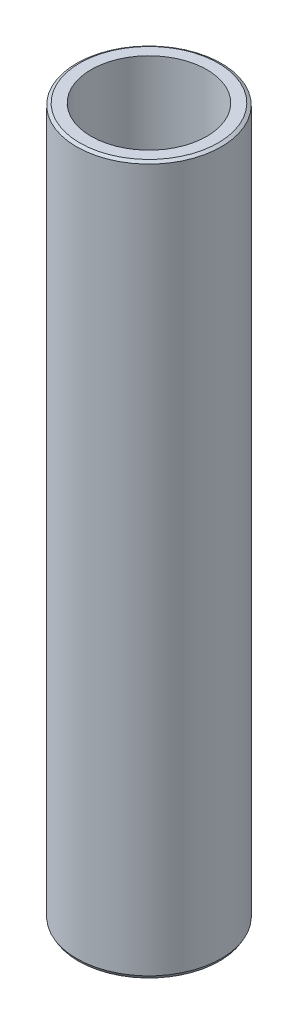
ISO-10303-21;
HEADER;
FILE_DESCRIPTION(('STEP AP214'),'2;1');
FILE_NAME('part.step','',(''),(''),'','','');
FILE_SCHEMA(('AUTOMOTIVE_DESIGN { 1 0 10303 214 1 1 1 1 }'));
ENDSEC;
DATA;
#1=APPLICATION_CONTEXT('core data for automotive mechanical design processes');
#2=APPLICATION_PROTOCOL_DEFINITION('international standard','automotive_design',2000,#1);
#3=PRODUCT_CONTEXT('',#1,'mechanical');
#4=PRODUCT('Part','Part','',(#3));
#5=PRODUCT_RELATED_PRODUCT_CATEGORY('part','',(#4));
#6=PRODUCT_DEFINITION_FORMATION('','',#4);
#7=PRODUCT_DEFINITION_CONTEXT('part definition',#1,'design');
#8=PRODUCT_DEFINITION('design','',#6,#7);
#9=PRODUCT_DEFINITION_SHAPE('','',#8);
#10=(LENGTH_UNIT() NAMED_UNIT(*) SI_UNIT(.MILLI.,.METRE.));
#11=(NAMED_UNIT(*) PLANE_ANGLE_UNIT() SI_UNIT($,.RADIAN.));
#12=(NAMED_UNIT(*) SI_UNIT($,.STERADIAN.) SOLID_ANGLE_UNIT());
#13=UNCERTAINTY_MEASURE_WITH_UNIT(LENGTH_MEASURE(1.E-05),#10,'distance_accuracy_value','');
#14=(GEOMETRIC_REPRESENTATION_CONTEXT(3) GLOBAL_UNCERTAINTY_ASSIGNED_CONTEXT((#13)) GLOBAL_UNIT_ASSIGNED_CONTEXT((#10,
#11,#12)) REPRESENTATION_CONTEXT('',''));
#15=CARTESIAN_POINT('',(0.,0.,0.));
#16=DIRECTION('',(0.,0.,1.));
#17=DIRECTION('',(1.,0.,0.));
#18=AXIS2_PLACEMENT_3D('',#15,#16,#17);
#19=CARTESIAN_POINT('',(0.,513.77342198026,0.));
#20=DIRECTION('',(0.,-1.,0.));
#21=DIRECTION('',(0.,0.,-1.));
#22=AXIS2_PLACEMENT_3D('',#19,#20,#21);
#23=CYLINDRICAL_SURFACE('',#22,52.5);
#24=CARTESIAN_POINT('',(0.,512.458148156772,0.));
#25=DIRECTION('',(0.,1.,0.));
#26=DIRECTION('',(0.,0.,1.));
#27=AXIS2_PLACEMENT_3D('',#24,#25,#26);
#28=CIRCLE('',#27,52.5);
#29=CARTESIAN_POINT('',(0.,512.458148156772,52.5));
#30=VERTEX_POINT('',#29);
#31=EDGE_CURVE('E50',#30,#30,#28,.F.);
#32=ORIENTED_EDGE('',*,*,#31,.T.);
#33=EDGE_LOOP('',(#32));
#34=FACE_BOUND('',#33,.T.);
#35=CARTESIAN_POINT('',(0.,2.27812108814751,0.));
#36=DIRECTION('',(0.,1.,0.));
#37=DIRECTION('',(0.,0.,1.));
#38=AXIS2_PLACEMENT_3D('',#35,#36,#37);
#39=CIRCLE('',#38,52.5);
#40=CARTESIAN_POINT('',(0.,2.27812108814751,52.5));
#41=VERTEX_POINT('',#40);
#42=EDGE_CURVE('E51',#41,#41,#39,.T.);
#43=ORIENTED_EDGE('',*,*,#42,.T.);
#44=EDGE_LOOP('',(#43));
#45=FACE_BOUND('',#44,.T.);
#46=ADVANCED_FACE('F39',(#34,#45),#23,.T.);
#47=CARTESIAN_POINT('',(0.,513.77342198026,0.));
#48=DIRECTION('',(0.,1.,0.));
#49=DIRECTION('',(0.,0.,1.));
#50=AXIS2_PLACEMENT_3D('',#47,#48,#49);
#51=PLANE('',#50);
#52=CARTESIAN_POINT('',(0.,513.77342198026,0.));
#53=DIRECTION('',(0.,1.,0.));
#54=DIRECTION('',(0.,0.,1.));
#55=AXIS2_PLACEMENT_3D('',#52,#53,#54);
#56=CIRCLE('',#55,50.2218789118524);
#57=CARTESIAN_POINT('',(0.,513.77342198026,50.2218789118524));
#58=VERTEX_POINT('',#57);
#59=EDGE_CURVE('E54',#58,#58,#56,.T.);
#60=ORIENTED_EDGE('',*,*,#59,.T.);
#61=EDGE_LOOP('',(#60));
#62=FACE_BOUND('',#61,.T.);
#63=CARTESIAN_POINT('',(0.,513.77342198026,0.));
#64=DIRECTION('',(0.,1.,0.));
#65=DIRECTION('',(0.,0.,1.));
#66=AXIS2_PLACEMENT_3D('',#63,#64,#65);
#67=CIRCLE('',#66,41.9791879624852);
#68=CARTESIAN_POINT('',(0.,513.77342198026,41.9791879624852));
#69=VERTEX_POINT('',#68);
#70=EDGE_CURVE('E58',#69,#69,#67,.T.);
#71=ORIENTED_EDGE('',*,*,#70,.F.);
#72=EDGE_LOOP('',(#71));
#73=FACE_BOUND('',#72,.T.);
#74=ADVANCED_FACE('F69',(#62,#73),#51,.T.);
#75=CARTESIAN_POINT('',(0.,0.,0.));
#76=DIRECTION('',(0.,1.,0.));
#77=DIRECTION('',(0.,0.,1.));
#78=AXIS2_PLACEMENT_3D('',#75,#76,#77);
#79=PLANE('',#78);
#80=CARTESIAN_POINT('',(0.,0.,0.));
#81=DIRECTION('',(0.,1.,0.));
#82=DIRECTION('',(0.,0.,1.));
#83=AXIS2_PLACEMENT_3D('',#80,#81,#82);
#84=CIRCLE('',#83,51.1847261765115);
#85=CARTESIAN_POINT('',(0.,0.,51.1847261765115));
#86=VERTEX_POINT('',#85);
#87=EDGE_CURVE('E10',#86,#86,#84,.F.);
#88=ORIENTED_EDGE('',*,*,#87,.T.);
#89=EDGE_LOOP('',(#88));
#90=FACE_BOUND('',#89,.T.);
#91=CARTESIAN_POINT('',(0.,0.,0.));
#92=DIRECTION('',(0.,1.,0.));
#93=DIRECTION('',(0.,0.,1.));
#94=AXIS2_PLACEMENT_3D('',#91,#92,#93);
#95=CIRCLE('',#94,41.9791879624852);
#96=CARTESIAN_POINT('',(0.,0.,41.9791879624852));
#97=VERTEX_POINT('',#96);
#98=EDGE_CURVE('E63',#97,#97,#95,.T.);
#99=ORIENTED_EDGE('',*,*,#98,.T.);
#100=EDGE_LOOP('',(#99));
#101=FACE_BOUND('',#100,.T.);
#102=ADVANCED_FACE('F75',(#90,#101),#79,.F.);
#103=CARTESIAN_POINT('',(0.,513.77342198026,0.));
#104=DIRECTION('',(0.,-1.,0.));
#105=DIRECTION('',(0.,0.,-1.));
#106=AXIS2_PLACEMENT_3D('',#103,#104,#105);
#107=CYLINDRICAL_SURFACE('',#106,41.9791879624852);
#108=ORIENTED_EDGE('',*,*,#70,.T.);
#109=EDGE_LOOP('',(#108));
#110=FACE_BOUND('',#109,.T.);
#111=ORIENTED_EDGE('',*,*,#98,.F.);
#112=EDGE_LOOP('',(#111));
#113=FACE_BOUND('',#112,.T.);
#114=ADVANCED_FACE('F70',(#110,#113),#107,.F.);
#115=CARTESIAN_POINT('',(0.,513.77342198026,0.));
#116=DIRECTION('',(0.,-1.,0.));
#117=DIRECTION('',(0.,0.,-1.));
#118=AXIS2_PLACEMENT_3D('',#115,#116,#117);
#119=CONICAL_SURFACE('',#118,50.2218789118524,1.04719755119659);
#120=ORIENTED_EDGE('',*,*,#31,.F.);
#121=EDGE_LOOP('',(#120));
#122=FACE_BOUND('',#121,.T.);
#123=ORIENTED_EDGE('',*,*,#59,.F.);
#124=EDGE_LOOP('',(#123));
#125=FACE_BOUND('',#124,.T.);
#126=ADVANCED_FACE('F81',(#122,#125),#119,.T.);
#127=CARTESIAN_POINT('',(0.,2.27812108814751,0.));
#128=DIRECTION('',(0.,1.,0.));
#129=DIRECTION('',(0.,0.,1.));
#130=AXIS2_PLACEMENT_3D('',#127,#128,#129);
#131=CONICAL_SURFACE('',#130,52.5,0.523598775598284);
#132=ORIENTED_EDGE('',*,*,#87,.F.);
#133=EDGE_LOOP('',(#132));
#134=FACE_BOUND('',#133,.T.);
#135=ORIENTED_EDGE('',*,*,#42,.F.);
#136=EDGE_LOOP('',(#135));
#137=FACE_BOUND('',#136,.T.);
#138=ADVANCED_FACE('F45',(#134,#137),#131,.T.);
#139=CLOSED_SHELL('',(#46,#74,#102,#114,#126,#138));
#140=MANIFOLD_SOLID_BREP('B2',#139);
#141=ADVANCED_BREP_SHAPE_REPRESENTATION('',(#18,#140),#14);
#142=SHAPE_DEFINITION_REPRESENTATION(#9,#141);
ENDSEC;
END-ISO-10303-21;
